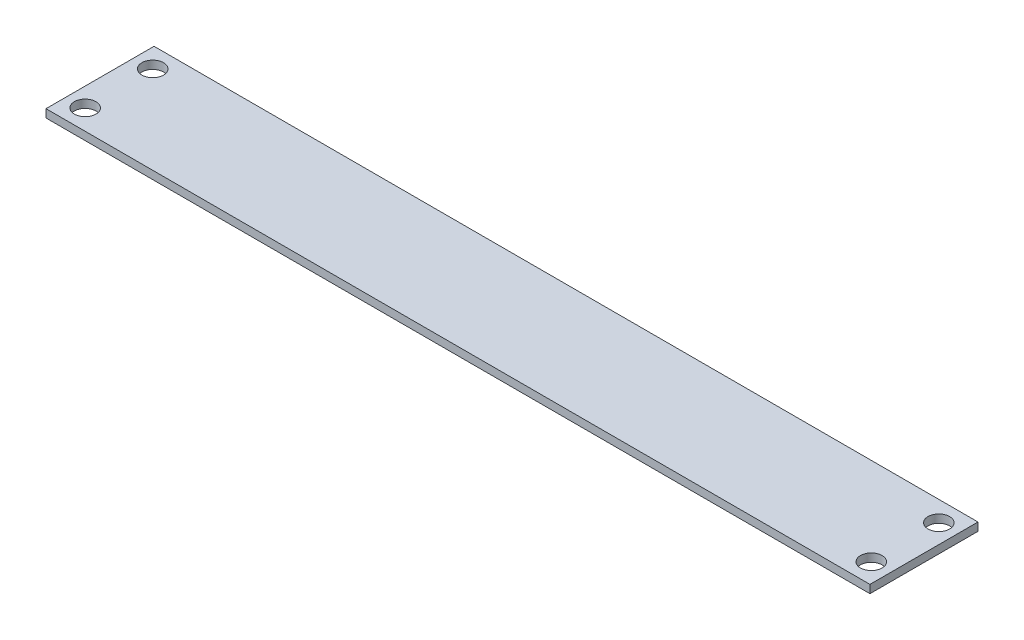
ISO-10303-21;
HEADER;
FILE_DESCRIPTION(('STEP AP214'),'2;1');
FILE_NAME('part.step','',(''),(''),'','','');
FILE_SCHEMA(('AUTOMOTIVE_DESIGN { 1 0 10303 214 1 1 1 1 }'));
ENDSEC;
DATA;
#1=APPLICATION_CONTEXT('core data for automotive mechanical design processes');
#2=APPLICATION_PROTOCOL_DEFINITION('international standard','automotive_design',2000,#1);
#3=PRODUCT_CONTEXT('',#1,'mechanical');
#4=PRODUCT('Part','Part','',(#3));
#5=PRODUCT_RELATED_PRODUCT_CATEGORY('part','',(#4));
#6=PRODUCT_DEFINITION_FORMATION('','',#4);
#7=PRODUCT_DEFINITION_CONTEXT('part definition',#1,'design');
#8=PRODUCT_DEFINITION('design','',#6,#7);
#9=PRODUCT_DEFINITION_SHAPE('','',#8);
#10=(LENGTH_UNIT() NAMED_UNIT(*) SI_UNIT(.MILLI.,.METRE.));
#11=(NAMED_UNIT(*) PLANE_ANGLE_UNIT() SI_UNIT($,.RADIAN.));
#12=(NAMED_UNIT(*) SI_UNIT($,.STERADIAN.) SOLID_ANGLE_UNIT());
#13=UNCERTAINTY_MEASURE_WITH_UNIT(LENGTH_MEASURE(1.E-05),#10,'distance_accuracy_value','');
#14=(GEOMETRIC_REPRESENTATION_CONTEXT(3) GLOBAL_UNCERTAINTY_ASSIGNED_CONTEXT((#13)) GLOBAL_UNIT_ASSIGNED_CONTEXT((#10,
#11,#12)) REPRESENTATION_CONTEXT('',''));
#15=CARTESIAN_POINT('',(0.,0.,0.));
#16=DIRECTION('',(0.,0.,1.));
#17=DIRECTION('',(1.,0.,0.));
#18=AXIS2_PLACEMENT_3D('',#15,#16,#17);
#19=CARTESIAN_POINT('',(0.,-3.,0.));
#20=DIRECTION('',(-1.,0.,0.));
#21=DIRECTION('',(0.,0.,1.));
#22=AXIS2_PLACEMENT_3D('',#19,#20,#21);
#23=PLANE('',#22);
#24=DIRECTION('',(0.,0.,1.));
#25=VECTOR('',#24,1.);
#26=CARTESIAN_POINT('',(0.,0.,0.));
#27=LINE('',#26,#25);
#28=CARTESIAN_POINT('',(0.,0.,-40.));
#29=VERTEX_POINT('',#28);
#30=CARTESIAN_POINT('',(0.,0.,0.));
#31=VERTEX_POINT('',#30);
#32=EDGE_CURVE('E103',#29,#31,#27,.T.);
#33=ORIENTED_EDGE('',*,*,#32,.F.);
#34=DIRECTION('',(0.,1.,0.));
#35=VECTOR('',#34,1.);
#36=CARTESIAN_POINT('',(0.,-3.,-40.));
#37=LINE('',#36,#35);
#38=CARTESIAN_POINT('',(0.,-3.,-40.));
#39=VERTEX_POINT('',#38);
#40=EDGE_CURVE('E11',#39,#29,#37,.T.);
#41=ORIENTED_EDGE('',*,*,#40,.F.);
#42=DIRECTION('',(0.,0.,1.));
#43=VECTOR('',#42,1.);
#44=CARTESIAN_POINT('',(0.,-3.,0.));
#45=LINE('',#44,#43);
#46=CARTESIAN_POINT('',(0.,-3.,0.));
#47=VERTEX_POINT('',#46);
#48=EDGE_CURVE('E96',#39,#47,#45,.T.);
#49=ORIENTED_EDGE('',*,*,#48,.T.);
#50=DIRECTION('',(0.,1.,0.));
#51=VECTOR('',#50,1.);
#52=CARTESIAN_POINT('',(0.,-3.,0.));
#53=LINE('',#52,#51);
#54=EDGE_CURVE('E41',#47,#31,#53,.T.);
#55=ORIENTED_EDGE('',*,*,#54,.T.);
#56=EDGE_LOOP('',(#33,#41,#49,#55));
#57=FACE_BOUND('',#56,.T.);
#58=ADVANCED_FACE('F38',(#57),#23,.T.);
#59=CARTESIAN_POINT('',(0.,-3.,-40.));
#60=DIRECTION('',(0.,0.,-1.));
#61=DIRECTION('',(-1.,0.,0.));
#62=AXIS2_PLACEMENT_3D('',#59,#60,#61);
#63=PLANE('',#62);
#64=DIRECTION('',(-1.,0.,0.));
#65=VECTOR('',#64,1.);
#66=CARTESIAN_POINT('',(0.,0.,-40.));
#67=LINE('',#66,#65);
#68=CARTESIAN_POINT('',(305.,0.,-40.));
#69=VERTEX_POINT('',#68);
#70=EDGE_CURVE('E98',#69,#29,#67,.T.);
#71=ORIENTED_EDGE('',*,*,#70,.F.);
#72=DIRECTION('',(0.,1.,0.));
#73=VECTOR('',#72,1.);
#74=CARTESIAN_POINT('',(305.,-3.,-40.));
#75=LINE('',#74,#73);
#76=CARTESIAN_POINT('',(305.,-3.,-40.));
#77=VERTEX_POINT('',#76);
#78=EDGE_CURVE('E47',#77,#69,#75,.T.);
#79=ORIENTED_EDGE('',*,*,#78,.F.);
#80=DIRECTION('',(-1.,0.,0.));
#81=VECTOR('',#80,1.);
#82=CARTESIAN_POINT('',(0.,-3.,-40.));
#83=LINE('',#82,#81);
#84=EDGE_CURVE('E93',#77,#39,#83,.T.);
#85=ORIENTED_EDGE('',*,*,#84,.T.);
#86=ORIENTED_EDGE('',*,*,#40,.T.);
#87=EDGE_LOOP('',(#71,#79,#85,#86));
#88=FACE_BOUND('',#87,.T.);
#89=ADVANCED_FACE('F114',(#88),#63,.T.);
#90=CARTESIAN_POINT('',(305.,-3.,0.));
#91=DIRECTION('',(1.,0.,0.));
#92=DIRECTION('',(0.,0.,-1.));
#93=AXIS2_PLACEMENT_3D('',#90,#91,#92);
#94=PLANE('',#93);
#95=DIRECTION('',(0.,0.,-1.));
#96=VECTOR('',#95,1.);
#97=CARTESIAN_POINT('',(305.,0.,0.));
#98=LINE('',#97,#96);
#99=CARTESIAN_POINT('',(305.,0.,0.));
#100=VERTEX_POINT('',#99);
#101=EDGE_CURVE('E88',#100,#69,#98,.T.);
#102=ORIENTED_EDGE('',*,*,#101,.F.);
#103=DIRECTION('',(0.,1.,0.));
#104=VECTOR('',#103,1.);
#105=CARTESIAN_POINT('',(305.,-3.,0.));
#106=LINE('',#105,#104);
#107=CARTESIAN_POINT('',(305.,-3.,0.));
#108=VERTEX_POINT('',#107);
#109=EDGE_CURVE('E83',#108,#100,#106,.T.);
#110=ORIENTED_EDGE('',*,*,#109,.F.);
#111=DIRECTION('',(0.,0.,-1.));
#112=VECTOR('',#111,1.);
#113=CARTESIAN_POINT('',(305.,-3.,0.));
#114=LINE('',#113,#112);
#115=EDGE_CURVE('E86',#108,#77,#114,.T.);
#116=ORIENTED_EDGE('',*,*,#115,.T.);
#117=ORIENTED_EDGE('',*,*,#78,.T.);
#118=EDGE_LOOP('',(#102,#110,#116,#117));
#119=FACE_BOUND('',#118,.T.);
#120=ADVANCED_FACE('F85',(#119),#94,.T.);
#121=CARTESIAN_POINT('',(0.,-3.,0.));
#122=DIRECTION('',(0.,0.,1.));
#123=DIRECTION('',(1.,0.,0.));
#124=AXIS2_PLACEMENT_3D('',#121,#122,#123);
#125=PLANE('',#124);
#126=DIRECTION('',(1.,0.,0.));
#127=VECTOR('',#126,1.);
#128=CARTESIAN_POINT('',(0.,0.,0.));
#129=LINE('',#128,#127);
#130=EDGE_CURVE('E106',#31,#100,#129,.T.);
#131=ORIENTED_EDGE('',*,*,#130,.F.);
#132=ORIENTED_EDGE('',*,*,#54,.F.);
#133=DIRECTION('',(1.,0.,0.));
#134=VECTOR('',#133,1.);
#135=CARTESIAN_POINT('',(0.,-3.,0.));
#136=LINE('',#135,#134);
#137=EDGE_CURVE('E92',#47,#108,#136,.T.);
#138=ORIENTED_EDGE('',*,*,#137,.T.);
#139=ORIENTED_EDGE('',*,*,#109,.T.);
#140=EDGE_LOOP('',(#131,#132,#138,#139));
#141=FACE_BOUND('',#140,.T.);
#142=ADVANCED_FACE('F95',(#141),#125,.T.);
#143=CARTESIAN_POINT('',(0.,-3.,0.));
#144=DIRECTION('',(0.,-1.,0.));
#145=DIRECTION('',(0.,0.,-1.));
#146=AXIS2_PLACEMENT_3D('',#143,#144,#145);
#147=PLANE('',#146);
#148=CARTESIAN_POINT('',(298.,-3.,-7.5));
#149=DIRECTION('',(0.,1.,0.));
#150=DIRECTION('',(0.,0.,1.));
#151=AXIS2_PLACEMENT_3D('',#148,#149,#150);
#152=CIRCLE('',#151,3.99999999999999);
#153=CARTESIAN_POINT('',(298.,-3.,-3.50000000000001));
#154=VERTEX_POINT('',#153);
#155=EDGE_CURVE('E155',#154,#154,#152,.T.);
#156=ORIENTED_EDGE('',*,*,#155,.T.);
#157=EDGE_LOOP('',(#156));
#158=FACE_BOUND('',#157,.T.);
#159=CARTESIAN_POINT('',(298.,-3.,-32.5));
#160=DIRECTION('',(0.,1.,0.));
#161=DIRECTION('',(0.,0.,1.));
#162=AXIS2_PLACEMENT_3D('',#159,#160,#161);
#163=CIRCLE('',#162,3.99999999999999);
#164=CARTESIAN_POINT('',(298.,-3.,-28.5));
#165=VERTEX_POINT('',#164);
#166=EDGE_CURVE('E163',#165,#165,#163,.T.);
#167=ORIENTED_EDGE('',*,*,#166,.T.);
#168=EDGE_LOOP('',(#167));
#169=FACE_BOUND('',#168,.T.);
#170=CARTESIAN_POINT('',(7.,-3.,-7.5));
#171=DIRECTION('',(0.,1.,0.));
#172=DIRECTION('',(0.,0.,1.));
#173=AXIS2_PLACEMENT_3D('',#170,#171,#172);
#174=CIRCLE('',#173,4.);
#175=CARTESIAN_POINT('',(7.,-3.,-3.5));
#176=VERTEX_POINT('',#175);
#177=EDGE_CURVE('E169',#176,#176,#174,.T.);
#178=ORIENTED_EDGE('',*,*,#177,.T.);
#179=EDGE_LOOP('',(#178));
#180=FACE_BOUND('',#179,.T.);
#181=CARTESIAN_POINT('',(7.,-3.,-32.5));
#182=DIRECTION('',(0.,1.,0.));
#183=DIRECTION('',(0.,0.,1.));
#184=AXIS2_PLACEMENT_3D('',#181,#182,#183);
#185=CIRCLE('',#184,4.);
#186=CARTESIAN_POINT('',(7.,-3.,-28.5));
#187=VERTEX_POINT('',#186);
#188=EDGE_CURVE('E107',#187,#187,#185,.T.);
#189=ORIENTED_EDGE('',*,*,#188,.T.);
#190=EDGE_LOOP('',(#189));
#191=FACE_BOUND('',#190,.T.);
#192=ORIENTED_EDGE('',*,*,#48,.F.);
#193=ORIENTED_EDGE('',*,*,#84,.F.);
#194=ORIENTED_EDGE('',*,*,#115,.F.);
#195=ORIENTED_EDGE('',*,*,#137,.F.);
#196=EDGE_LOOP('',(#192,#193,#194,#195));
#197=FACE_BOUND('',#196,.T.);
#198=ADVANCED_FACE('F91',(#158,#169,#180,#191,#197),#147,.T.);
#199=CARTESIAN_POINT('',(0.,0.,0.));
#200=DIRECTION('',(0.,-1.,0.));
#201=DIRECTION('',(0.,0.,-1.));
#202=AXIS2_PLACEMENT_3D('',#199,#200,#201);
#203=PLANE('',#202);
#204=CARTESIAN_POINT('',(298.,0.,-7.5));
#205=DIRECTION('',(0.,1.,0.));
#206=DIRECTION('',(0.,0.,1.));
#207=AXIS2_PLACEMENT_3D('',#204,#205,#206);
#208=CIRCLE('',#207,3.99999999999999);
#209=CARTESIAN_POINT('',(298.,0.,-3.50000000000001));
#210=VERTEX_POINT('',#209);
#211=EDGE_CURVE('E158',#210,#210,#208,.T.);
#212=ORIENTED_EDGE('',*,*,#211,.F.);
#213=EDGE_LOOP('',(#212));
#214=FACE_BOUND('',#213,.T.);
#215=CARTESIAN_POINT('',(298.,0.,-32.5));
#216=DIRECTION('',(0.,1.,0.));
#217=DIRECTION('',(0.,0.,1.));
#218=AXIS2_PLACEMENT_3D('',#215,#216,#217);
#219=CIRCLE('',#218,3.99999999999999);
#220=CARTESIAN_POINT('',(298.,0.,-28.5));
#221=VERTEX_POINT('',#220);
#222=EDGE_CURVE('E160',#221,#221,#219,.T.);
#223=ORIENTED_EDGE('',*,*,#222,.F.);
#224=EDGE_LOOP('',(#223));
#225=FACE_BOUND('',#224,.T.);
#226=CARTESIAN_POINT('',(7.,0.,-7.5));
#227=DIRECTION('',(0.,1.,0.));
#228=DIRECTION('',(0.,0.,1.));
#229=AXIS2_PLACEMENT_3D('',#226,#227,#228);
#230=CIRCLE('',#229,4.);
#231=CARTESIAN_POINT('',(7.,0.,-3.5));
#232=VERTEX_POINT('',#231);
#233=EDGE_CURVE('E166',#232,#232,#230,.T.);
#234=ORIENTED_EDGE('',*,*,#233,.F.);
#235=EDGE_LOOP('',(#234));
#236=FACE_BOUND('',#235,.T.);
#237=CARTESIAN_POINT('',(7.,0.,-32.5));
#238=DIRECTION('',(0.,1.,0.));
#239=DIRECTION('',(0.,0.,1.));
#240=AXIS2_PLACEMENT_3D('',#237,#238,#239);
#241=CIRCLE('',#240,4.);
#242=CARTESIAN_POINT('',(7.,0.,-28.5));
#243=VERTEX_POINT('',#242);
#244=EDGE_CURVE('E172',#243,#243,#241,.T.);
#245=ORIENTED_EDGE('',*,*,#244,.F.);
#246=EDGE_LOOP('',(#245));
#247=FACE_BOUND('',#246,.T.);
#248=ORIENTED_EDGE('',*,*,#32,.T.);
#249=ORIENTED_EDGE('',*,*,#130,.T.);
#250=ORIENTED_EDGE('',*,*,#101,.T.);
#251=ORIENTED_EDGE('',*,*,#70,.T.);
#252=EDGE_LOOP('',(#248,#249,#250,#251));
#253=FACE_BOUND('',#252,.T.);
#254=ADVANCED_FACE('F113',(#214,#225,#236,#247,#253),#203,.F.);
#255=CARTESIAN_POINT('',(7.,-3.,-32.5));
#256=DIRECTION('',(0.,1.,0.));
#257=DIRECTION('',(0.,0.,1.));
#258=AXIS2_PLACEMENT_3D('',#255,#256,#257);
#259=CYLINDRICAL_SURFACE('',#258,4.);
#260=ORIENTED_EDGE('',*,*,#188,.F.);
#261=EDGE_LOOP('',(#260));
#262=FACE_BOUND('',#261,.T.);
#263=ORIENTED_EDGE('',*,*,#244,.T.);
#264=EDGE_LOOP('',(#263));
#265=FACE_BOUND('',#264,.T.);
#266=ADVANCED_FACE('F132',(#262,#265),#259,.F.);
#267=CARTESIAN_POINT('',(7.,-3.,-7.5));
#268=DIRECTION('',(0.,1.,0.));
#269=DIRECTION('',(0.,0.,1.));
#270=AXIS2_PLACEMENT_3D('',#267,#268,#269);
#271=CYLINDRICAL_SURFACE('',#270,4.);
#272=ORIENTED_EDGE('',*,*,#177,.F.);
#273=EDGE_LOOP('',(#272));
#274=FACE_BOUND('',#273,.T.);
#275=ORIENTED_EDGE('',*,*,#233,.T.);
#276=EDGE_LOOP('',(#275));
#277=FACE_BOUND('',#276,.T.);
#278=ADVANCED_FACE('F139',(#274,#277),#271,.F.);
#279=CARTESIAN_POINT('',(298.,-3.,-32.5));
#280=DIRECTION('',(0.,1.,0.));
#281=DIRECTION('',(0.,0.,1.));
#282=AXIS2_PLACEMENT_3D('',#279,#280,#281);
#283=CYLINDRICAL_SURFACE('',#282,3.99999999999999);
#284=ORIENTED_EDGE('',*,*,#166,.F.);
#285=EDGE_LOOP('',(#284));
#286=FACE_BOUND('',#285,.T.);
#287=ORIENTED_EDGE('',*,*,#222,.T.);
#288=EDGE_LOOP('',(#287));
#289=FACE_BOUND('',#288,.T.);
#290=ADVANCED_FACE('F143',(#286,#289),#283,.F.);
#291=CARTESIAN_POINT('',(298.,-3.,-7.5));
#292=DIRECTION('',(0.,1.,0.));
#293=DIRECTION('',(0.,0.,1.));
#294=AXIS2_PLACEMENT_3D('',#291,#292,#293);
#295=CYLINDRICAL_SURFACE('',#294,3.99999999999999);
#296=ORIENTED_EDGE('',*,*,#155,.F.);
#297=EDGE_LOOP('',(#296));
#298=FACE_BOUND('',#297,.T.);
#299=ORIENTED_EDGE('',*,*,#211,.T.);
#300=EDGE_LOOP('',(#299));
#301=FACE_BOUND('',#300,.T.);
#302=ADVANCED_FACE('F147',(#298,#301),#295,.F.);
#303=CLOSED_SHELL('',(#58,#89,#120,#142,#198,#254,#266,#278,#290,#302));
#304=MANIFOLD_SOLID_BREP('B2',#303);
#305=ADVANCED_BREP_SHAPE_REPRESENTATION('',(#18,#304),#14);
#306=SHAPE_DEFINITION_REPRESENTATION(#9,#305);
ENDSEC;
END-ISO-10303-21;
